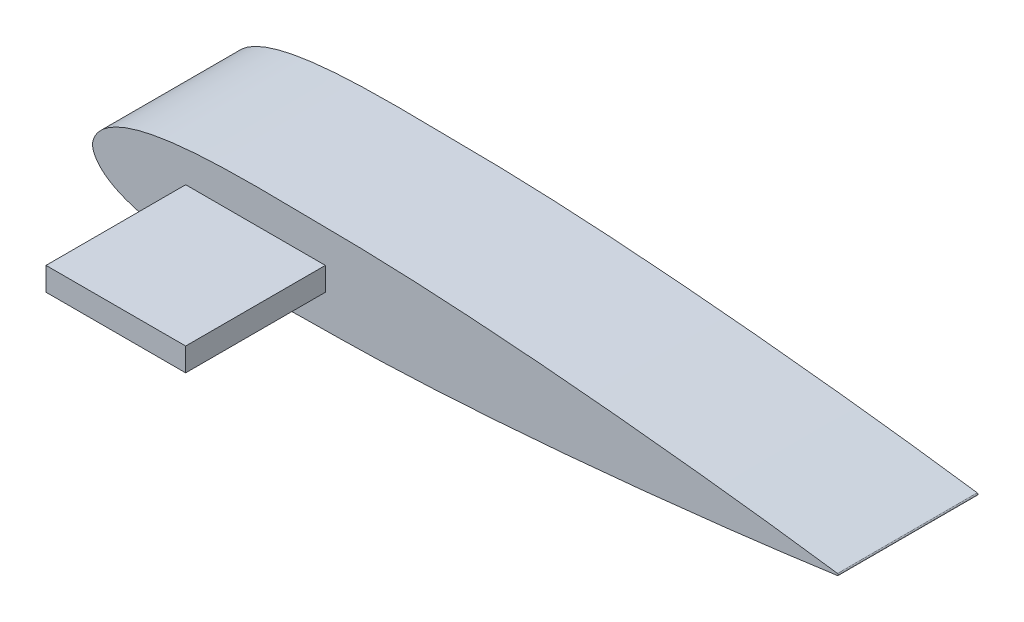
ISO-10303-21;
HEADER;
FILE_DESCRIPTION(('STEP AP214'),'2;1');
FILE_NAME('part.step','',(''),(''),'','','');
FILE_SCHEMA(('AUTOMOTIVE_DESIGN { 1 0 10303 214 1 1 1 1 }'));
ENDSEC;
DATA;
#1=APPLICATION_CONTEXT('core data for automotive mechanical design processes');
#2=APPLICATION_PROTOCOL_DEFINITION('international standard','automotive_design',2000,#1);
#3=PRODUCT_CONTEXT('',#1,'mechanical');
#4=PRODUCT('Part','Part','',(#3));
#5=PRODUCT_RELATED_PRODUCT_CATEGORY('part','',(#4));
#6=PRODUCT_DEFINITION_FORMATION('','',#4);
#7=PRODUCT_DEFINITION_CONTEXT('part definition',#1,'design');
#8=PRODUCT_DEFINITION('design','',#6,#7);
#9=PRODUCT_DEFINITION_SHAPE('','',#8);
#10=(LENGTH_UNIT() NAMED_UNIT(*) SI_UNIT(.MILLI.,.METRE.));
#11=(NAMED_UNIT(*) PLANE_ANGLE_UNIT() SI_UNIT($,.RADIAN.));
#12=(NAMED_UNIT(*) SI_UNIT($,.STERADIAN.) SOLID_ANGLE_UNIT());
#13=UNCERTAINTY_MEASURE_WITH_UNIT(LENGTH_MEASURE(1.E-05),#10,'distance_accuracy_value','');
#14=(GEOMETRIC_REPRESENTATION_CONTEXT(3) GLOBAL_UNCERTAINTY_ASSIGNED_CONTEXT((#13)) GLOBAL_UNIT_ASSIGNED_CONTEXT((#10,
#11,#12)) REPRESENTATION_CONTEXT('',''));
#15=CARTESIAN_POINT('',(0.,0.,0.));
#16=DIRECTION('',(0.,0.,1.));
#17=DIRECTION('',(1.,0.,0.));
#18=AXIS2_PLACEMENT_3D('',#15,#16,#17);
#19=CARTESIAN_POINT('',(0.,0.,19.05));
#20=DIRECTION('',(0.,0.,-1.));
#21=DIRECTION('',(-1.,0.,0.));
#22=AXIS2_PLACEMENT_3D('',#19,#20,#21);
#23=PLANE('',#22);
#24=CARTESIAN_POINT('',(101.6,0.128016,19.05));
#25=CARTESIAN_POINT('',(99.9070525686489,0.361535680483752,19.05));
#26=CARTESIAN_POINT('',(96.5229164717886,0.828332442992591,19.05));
#27=CARTESIAN_POINT('',(91.4421492577237,1.47630030962038,19.05));
#28=CARTESIAN_POINT('',(86.3620924886139,2.09178126516891,19.05));
#29=CARTESIAN_POINT('',(81.2818156311416,2.67021221482046,19.05));
#30=CARTESIAN_POINT('',(76.2017253814292,3.21595120615532,19.05));
#31=CARTESIAN_POINT('',(71.121704180204,3.72825746019504,19.05));
#32=CARTESIAN_POINT('',(66.0417841390404,4.20575704869902,19.05));
#33=CARTESIAN_POINT('',(60.9616764331955,4.64253588953135,19.05));
#34=CARTESIAN_POINT('',(55.8817526532358,5.03930700648654,19.05));
#35=CARTESIAN_POINT('',(50.7678428194317,5.38918365630372,19.05));
#36=CARTESIAN_POINT('',(45.6540861041713,5.68859269736138,19.05));
#37=CARTESIAN_POINT('',(40.539786385583,5.91027725447503,19.05));
#38=CARTESIAN_POINT('',(35.4594528350958,6.07407688155428,19.05));
#39=CARTESIAN_POINT('',(31.2585547163106,6.07121409884639,19.05));
#40=CARTESIAN_POINT('',(27.9062675236392,6.14928148727748,19.05));
#41=CARTESIAN_POINT('',(25.4001018022535,6.18417960376085,19.05));
#42=CARTESIAN_POINT('',(22.8600220343402,6.20252953344677,19.05));
#43=CARTESIAN_POINT('',(20.3197357018366,6.19130087341561,19.05));
#44=CARTESIAN_POINT('',(17.7791320847082,6.13859002493525,19.05));
#45=CARTESIAN_POINT('',(15.237819283157,6.03130684308064,19.05));
#46=CARTESIAN_POINT('',(12.6953765566976,5.84803534367875,19.05));
#47=CARTESIAN_POINT('',(10.3212425379229,5.58374145495773,19.05));
#48=CARTESIAN_POINT('',(8.1155285196929,5.22207188365709,19.05));
#49=CARTESIAN_POINT('',(6.42081947250496,4.83639909682632,19.05));
#50=CARTESIAN_POINT('',(5.07016160115596,4.42804218390638,19.05));
#51=CARTESIAN_POINT('',(4.04787795903987,4.0544099749082,19.05));
#52=CARTESIAN_POINT('',(3.01958674061395,3.58589384815148,19.05));
#53=CARTESIAN_POINT('',(1.97308490887708,2.97200164858176,19.05));
#54=CARTESIAN_POINT('',(1.10498460338645,2.25405553792827,19.05));
#55=CARTESIAN_POINT('',(0.340437319969994,1.29305291435777,19.05));
#56=CARTESIAN_POINT('',(-0.22230643968445,0.,19.05));
#57=CARTESIAN_POINT('',(0.340437319970007,-1.29305291435779,19.05));
#58=CARTESIAN_POINT('',(1.10498460338643,-2.25405553792825,19.05));
#59=CARTESIAN_POINT('',(1.97308490887709,-2.97200164858177,19.05));
#60=CARTESIAN_POINT('',(3.01958674061396,-3.58589384815148,19.05));
#61=CARTESIAN_POINT('',(4.04787795903985,-4.05440997490819,19.05));
#62=CARTESIAN_POINT('',(5.07016160115597,-4.42804218390638,19.05));
#63=CARTESIAN_POINT('',(6.42081947250497,-4.83639909682632,19.05));
#64=CARTESIAN_POINT('',(8.11552851969289,-5.22207188365709,19.05));
#65=CARTESIAN_POINT('',(10.3212425379228,-5.58374145495773,19.05));
#66=CARTESIAN_POINT('',(12.6953765566976,-5.84803534367876,19.05));
#67=CARTESIAN_POINT('',(15.237819283157,-6.03130684308063,19.05));
#68=CARTESIAN_POINT('',(17.7791320847082,-6.13859002493526,19.05));
#69=CARTESIAN_POINT('',(20.3197357018365,-6.19130087341561,19.05));
#70=CARTESIAN_POINT('',(22.8600220343402,-6.20252953344676,19.05));
#71=CARTESIAN_POINT('',(25.4001018022535,-6.18417960376085,19.05));
#72=CARTESIAN_POINT('',(27.9062675236393,-6.14928148727748,19.05));
#73=CARTESIAN_POINT('',(31.2585547163106,-6.07121409884639,19.05));
#74=CARTESIAN_POINT('',(35.4594528350959,-6.07407688155429,19.05));
#75=CARTESIAN_POINT('',(40.539786385583,-5.91027725447503,19.05));
#76=CARTESIAN_POINT('',(45.6540861041713,-5.68859269736138,19.05));
#77=CARTESIAN_POINT('',(50.7678428194317,-5.38918365630372,19.05));
#78=CARTESIAN_POINT('',(55.8817526532358,-5.03930700648654,19.05));
#79=CARTESIAN_POINT('',(60.9616764331955,-4.64253588953135,19.05));
#80=CARTESIAN_POINT('',(66.0417841390405,-4.20575704869902,19.05));
#81=CARTESIAN_POINT('',(71.121704180204,-3.72825746019504,19.05));
#82=CARTESIAN_POINT('',(76.2017253814292,-3.21595120615532,19.05));
#83=CARTESIAN_POINT('',(81.2818156311416,-2.67021221482046,19.05));
#84=CARTESIAN_POINT('',(86.3620924886139,-2.09178126516891,19.05));
#85=CARTESIAN_POINT('',(91.4421492577237,-1.47630030962038,19.05));
#86=CARTESIAN_POINT('',(96.5229164717886,-0.82833244299259,19.05));
#87=CARTESIAN_POINT('',(99.9070525686489,-0.361535680483752,19.05));
#88=CARTESIAN_POINT('',(101.6,-0.128016,19.05));
#89=B_SPLINE_CURVE_WITH_KNOTS('',3,(#24,#25,#26,#27,#28,#29,#30,#31,#32,#33,#34,#35,#36,#37,#38,
#39,#40,#41,#42,#43,#44,#45,#46,#47,#48,#49,#50,#51,#52,#53,#54,#55,#56,#57,#58,#59,#60,#61,#62,
#63,#64,#65,#66,#67,#68,#69,#70,#71,#72,#73,#74,#75,#76,#77,#78,#79,#80,#81,#82,#83,#84,#85,#86,
#87,#88),.UNSPECIFIED.,.F.,.F.,(4,1,1,1,1,1,1,1,1,1,1,1,1,1,1,1,1,1,1,1,1,1,1,1,1,1,1,1,1,1,1,1,
1,1,1,1,1,1,1,1,1,1,1,1,1,1,1,1,1,1,1,1,1,1,1,1,1,1,1,1,1,1,4),(0.,0.0246342312292194,
0.0492428704975633,0.0738297802420855,0.0983967509771365,0.12294599647171,0.147478561830958,
0.171994580547558,0.196493552150553,0.220976186079776,0.245442092511756,0.270380478282193,
0.29481296851854,0.319231823090472,0.343641966678299,0.355360377987929,0.367566080213977,
0.379770767093903,0.391975369032391,0.404182652687053,0.416398684188303,0.428636131953062,
0.440920171219084,0.450818129389003,0.460843203047005,0.465945570893321,0.471149096279721,
0.476522597740141,0.482208155426325,0.488618356982003,0.492567758031601,0.5,0.507432241968398,
0.511381643017996,0.517791844573675,0.523477402259858,0.528850903720279,0.534054429106679,
0.539156796952995,0.549181870610997,0.559079828780916,0.571363868046937,0.583601315811697,
0.595817347312947,0.608024630967609,0.620229232906097,0.632433919786023,0.644639622012071,
0.656358033321701,0.680768176909528,0.70518703148146,0.729619521717807,0.754557907488244,
0.779023813920224,0.803506447849447,0.828005419452442,0.852521438169042,0.87705400352829,
0.901603249022864,0.926170219757915,0.950757129502437,0.975365768770781,1.),.UNSPECIFIED.);
#90=CARTESIAN_POINT('',(101.6,0.128016,19.05));
#91=VERTEX_POINT('',#90);
#92=CARTESIAN_POINT('',(101.6,-0.128016,19.05));
#93=VERTEX_POINT('',#92);
#94=EDGE_CURVE('E117',#91,#93,#89,.T.);
#95=ORIENTED_EDGE('',*,*,#94,.T.);
#96=CARTESIAN_POINT('',(101.582341887962,0.,19.05));
#97=DIRECTION('',(0.,0.,-1.));
#98=DIRECTION('',(-1.,0.,0.));
#99=AXIS2_PLACEMENT_3D('',#96,#97,#98);
#100=CIRCLE('',#99,0.129228112950463);
#101=EDGE_CURVE('E122',#91,#93,#100,.T.);
#102=ORIENTED_EDGE('',*,*,#101,.F.);
#103=EDGE_LOOP('',(#95,#102));
#104=FACE_BOUND('',#103,.T.);
#105=DIRECTION('',(0.,1.,0.));
#106=VECTOR('',#105,1.);
#107=CARTESIAN_POINT('',(31.75,1.58749999999999,19.05));
#108=LINE('',#107,#106);
#109=CARTESIAN_POINT('',(31.75,-1.58750000000001,19.05));
#110=VERTEX_POINT('',#109);
#111=CARTESIAN_POINT('',(31.75,1.58749999999999,19.05));
#112=VERTEX_POINT('',#111);
#113=EDGE_CURVE('E108',#110,#112,#108,.T.);
#114=ORIENTED_EDGE('',*,*,#113,.F.);
#115=DIRECTION('',(1.,0.,0.));
#116=VECTOR('',#115,1.);
#117=CARTESIAN_POINT('',(12.7,-1.5875,19.05));
#118=LINE('',#117,#116);
#119=CARTESIAN_POINT('',(12.7,-1.5875,19.05));
#120=VERTEX_POINT('',#119);
#121=EDGE_CURVE('E105',#120,#110,#118,.T.);
#122=ORIENTED_EDGE('',*,*,#121,.F.);
#123=DIRECTION('',(0.,-1.,0.));
#124=VECTOR('',#123,1.);
#125=CARTESIAN_POINT('',(12.7,1.5875,19.05));
#126=LINE('',#125,#124);
#127=CARTESIAN_POINT('',(12.7,1.5875,19.05));
#128=VERTEX_POINT('',#127);
#129=EDGE_CURVE('E56',#128,#120,#126,.T.);
#130=ORIENTED_EDGE('',*,*,#129,.F.);
#131=DIRECTION('',(-1.,0.,0.));
#132=VECTOR('',#131,1.);
#133=CARTESIAN_POINT('',(12.7,1.5875,19.05));
#134=LINE('',#133,#132);
#135=EDGE_CURVE('E51',#112,#128,#134,.T.);
#136=ORIENTED_EDGE('',*,*,#135,.F.);
#137=EDGE_LOOP('',(#114,#122,#130,#136));
#138=FACE_BOUND('',#137,.T.);
#139=ADVANCED_FACE('F34',(#104,#138),#23,.F.);
#140=DIRECTION('',(0.,0.,-1.));
#141=VECTOR('',#140,1.);
#142=SURFACE_OF_LINEAR_EXTRUSION('',#89,#141);
#143=CARTESIAN_POINT('',(0.,0.,8.50265));
#144=CARTESIAN_POINT('',(5.27297745446789E-06,-0.0819379022860038,8.50264569991496));
#145=CARTESIAN_POINT('',(0.00576878084309566,-0.163906613489102,8.49793227856266));
#146=CARTESIAN_POINT('',(0.0270354998837502,-0.325579604478864,8.47945144242909));
#147=CARTESIAN_POINT('',(0.0425609251906983,-0.405278285050481,8.4656633741093));
#148=CARTESIAN_POINT('',(0.0878332213943048,-0.587876103637676,8.42361052006383));
#149=CARTESIAN_POINT('',(0.120645312125647,-0.689231418469879,8.39198283534314));
#150=CARTESIAN_POINT('',(0.194980823694499,-0.883483705903361,8.31578155192591));
#151=CARTESIAN_POINT('',(0.236519764525446,-0.976365180629454,8.27118483382805));
#152=CARTESIAN_POINT('',(0.337959118952399,-1.18044529217273,8.15504200917571));
#153=CARTESIAN_POINT('',(0.399573519638046,-1.28847022132582,8.07942617209769));
#154=CARTESIAN_POINT('',(0.52430615134443,-1.48880826277208,7.9103051719675));
#155=CARTESIAN_POINT('',(0.587426770939702,-1.58109422690754,7.81676967756697));
#156=CARTESIAN_POINT('',(0.679345749227089,-1.70676409420828,7.66349486531671));
#157=CARTESIAN_POINT('',(0.709668624037716,-1.74669344771915,7.60994262215782));
#158=CARTESIAN_POINT('',(0.76847278558102,-1.82180665001905,7.49867008001883));
#159=CARTESIAN_POINT('',(0.796953663116366,-1.85698944623881,7.44094886089335));
#160=CARTESIAN_POINT('',(0.878040658368946,-1.95461720174609,7.26198945296045));
#161=CARTESIAN_POINT('',(0.926616604668019,-2.00956897671471,7.13444211147783));
#162=CARTESIAN_POINT('',(0.989678604194627,-2.07902433424149,6.91525242990505));
#163=CARTESIAN_POINT('',(1.01013229922783,-2.10097104335402,6.82763779092426));
#164=CARTESIAN_POINT('',(1.04097151197828,-2.13376618627341,6.64864100314995));
#165=CARTESIAN_POINT('',(1.0513700237001,-2.14462894453492,6.55726387623182));
#166=CARTESIAN_POINT('',(1.06082348861863,-2.15451254259831,6.37293313514296));
#167=CARTESIAN_POINT('',(1.05983694164607,-2.15349005889316,6.27997498753979));
#168=CARTESIAN_POINT('',(1.04655407184701,-2.13958124329582,6.09576139502295));
#169=CARTESIAN_POINT('',(1.03425184927556,-2.12668872262346,6.00450686366257));
#170=CARTESIAN_POINT('',(1.00054510853139,-2.09066859802511,5.82974661096816));
#171=CARTESIAN_POINT('',(0.979518117744493,-2.06796404619203,5.74607725754933));
#172=CARTESIAN_POINT('',(0.930410143546462,-2.01354919355438,5.58393815026089));
#173=CARTESIAN_POINT('',(0.902324398494378,-1.98183281172488,5.50547195163561));
#174=CARTESIAN_POINT('',(0.825473592053192,-1.89214170333521,5.31576518706433));
#175=CARTESIAN_POINT('',(0.773469227593745,-1.82902621688164,5.20823088145486));
#176=CARTESIAN_POINT('',(0.69139006852295,-1.72263942199431,5.05763306391927));
#177=CARTESIAN_POINT('',(0.663305844048993,-1.68515906437614,5.00915231987606));
#178=CARTESIAN_POINT('',(0.6063615358489,-1.60645401872654,4.91579968003716));
#179=CARTESIAN_POINT('',(0.577501558170746,-1.56522984067325,4.87092729428121));
#180=CARTESIAN_POINT('',(0.519035664613744,-1.47847028133751,4.78415910983546));
#181=CARTESIAN_POINT('',(0.489425511097586,-1.43287232125673,4.74232876017643));
#182=CARTESIAN_POINT('',(0.430550761647529,-1.33813170866598,4.66265306723614));
#183=CARTESIAN_POINT('',(0.401286217933015,-1.28898852827253,4.62480831948342));
#184=CARTESIAN_POINT('',(0.315080522660227,-1.13642902840977,4.51755213949847));
#185=CARTESIAN_POINT('',(0.259590558916261,-1.02768781610142,4.45422312473935));
#186=CARTESIAN_POINT('',(0.173156067918237,-0.829166584260447,4.36132620389828));
#187=CARTESIAN_POINT('',(0.139682870947213,-0.742561649740116,4.32726857005532));
#188=CARTESIAN_POINT('',(0.0813519520906431,-0.562977588102633,4.27014985538041));
#189=CARTESIAN_POINT('',(0.0564787931701374,-0.470010244753397,4.24706904292772));
#190=CARTESIAN_POINT('',(0.0300360285614016,-0.335408732375718,4.22326248393349));
#191=CARTESIAN_POINT('',(0.023352858327886,-0.295627534311367,4.21736330992345));
#192=CARTESIAN_POINT('',(0.0123569025249586,-0.215468710190673,4.20778128666012));
#193=CARTESIAN_POINT('',(0.00804369421659355,-0.175091191822529,4.20409804213209));
#194=CARTESIAN_POINT('',(0.00203373570966123,-0.0940434445222412,4.1990223180909));
#195=CARTESIAN_POINT('',(0.000333875170249198,-0.0533736215215362,4.19762711527582));
#196=CARTESIAN_POINT('',(-0.000242639782308908,0.028000945779852,4.19714765050881));
#197=CARTESIAN_POINT('',(0.000880721042310461,0.0687056902678314,4.19806340102979));
#198=CARTESIAN_POINT('',(0.00578419873767443,0.149754638467166,4.20218274780663));
#199=CARTESIAN_POINT('',(0.00955917636691393,0.190099386975481,4.20538191863569));
#200=CARTESIAN_POINT('',(0.019515804630534,0.270244227284104,4.21399991956397));
#201=CARTESIAN_POINT('',(0.0256976408294799,0.310044276844109,4.2194189208099));
#202=CARTESIAN_POINT('',(0.047494346848156,0.428448719806667,4.23890292270258));
#203=CARTESIAN_POINT('',(0.0663524253880954,0.505946541120688,4.25618894042602));
#204=CARTESIAN_POINT('',(0.120401735917819,0.690422279938789,4.30792665038461));
#205=CARTESIAN_POINT('',(0.159126641486786,0.795154365339017,4.34659481021188));
#206=CARTESIAN_POINT('',(0.244591670356743,0.994743689506902,4.43781160565646));
#207=CARTESIAN_POINT('',(0.291341065214728,1.0895892993146,4.49037633585815));
#208=CARTESIAN_POINT('',(0.390095308934518,1.27173315435935,4.60965495196076));
#209=CARTESIAN_POINT('',(0.442215829679008,1.35871917035315,4.6767463756076));
#210=CARTESIAN_POINT('',(0.546817865009065,1.52156912619519,4.82332434097868));
#211=CARTESIAN_POINT('',(0.599299761626901,1.59741841883289,4.90282692766585));
#212=CARTESIAN_POINT('',(0.681459199181328,1.70959493505492,5.04015769257329));
#213=CARTESIAN_POINT('',(0.712037075639482,1.74978731034181,5.09432238456255));
#214=CARTESIAN_POINT('',(0.771289439250748,1.82532958743838,5.20689724469323));
#215=CARTESIAN_POINT('',(0.799963289602565,1.86067787330575,5.26530881965711));
#216=CARTESIAN_POINT('',(0.881522782108256,1.95866882444628,5.44652696590748));
#217=CARTESIAN_POINT('',(0.93023708224082,2.01363854329762,5.57577591525897));
#218=CARTESIAN_POINT('',(0.992658618542065,2.0822484732758,5.7967612282397));
#219=CARTESIAN_POINT('',(1.01264245815644,2.10365716434293,5.88436623004175));
#220=CARTESIAN_POINT('',(1.0425116223248,2.13538442951363,6.06321463959676));
#221=CARTESIAN_POINT('',(1.05241147113133,2.14571895516547,6.1544526171534));
#222=CARTESIAN_POINT('',(1.06090182573181,2.15459285052455,6.33836012370663));
#223=CARTESIAN_POINT('',(1.05945280133512,2.15309099183727,6.43103353333707));
#224=CARTESIAN_POINT('',(1.04534706974842,2.13831405652029,6.61458303454195));
#225=CARTESIAN_POINT('',(1.03268383593385,2.12503212392831,6.70545804796502));
#226=CARTESIAN_POINT('',(0.998323194600174,2.08827423535252,6.87979157643695));
#227=CARTESIAN_POINT('',(0.976960573719846,2.06517479187235,6.96339866558147));
#228=CARTESIAN_POINT('',(0.927242059395651,2.00998855361192,7.12536042657858));
#229=CARTESIAN_POINT('',(0.898881591632752,1.97789587830959,7.20371162000309));
#230=CARTESIAN_POINT('',(0.821314543264629,1.88715337862493,7.39335171928172));
#231=CARTESIAN_POINT('',(0.76888343496205,1.82333011868811,7.5008839972423));
#232=CARTESIAN_POINT('',(0.686251756924249,1.71583655215325,7.65139440515074));
#233=CARTESIAN_POINT('',(0.657996604779066,1.67797746168109,7.69983347274351));
#234=CARTESIAN_POINT('',(0.600741999170647,1.5984988458451,7.79307023090873));
#235=CARTESIAN_POINT('',(0.571742649791723,1.55687984431685,7.83786842708504));
#236=CARTESIAN_POINT('',(0.5130364065974,1.46932094502884,7.92443756573085));
#237=CARTESIAN_POINT('',(0.483325896912789,1.4233192947279,7.96614358758782));
#238=CARTESIAN_POINT('',(0.424299955660585,1.32775237342525,8.04553465284858));
#239=CARTESIAN_POINT('',(0.394984589305083,1.27818652255659,8.08321903947582));
#240=CARTESIAN_POINT('',(0.30872555410264,1.12434920553881,8.18991679105747));
#241=CARTESIAN_POINT('',(0.253318016666683,1.0147218714877,8.25278924606958));
#242=CARTESIAN_POINT('',(0.168548901931722,0.817427175612811,8.34340621984688));
#243=CARTESIAN_POINT('',(0.136382661226998,0.733172795845487,8.37602210707059));
#244=CARTESIAN_POINT('',(0.080253492237958,0.558766659413231,8.43086244315612));
#245=CARTESIAN_POINT('',(0.0562730679433934,0.468627977455501,8.45310909247439));
#246=CARTESIAN_POINT('',(0.0259749303990928,0.314954946989522,8.48039842188837));
#247=CARTESIAN_POINT('',(0.0164312088837174,0.252628272080054,8.48870809432831));
#248=CARTESIAN_POINT('',(0.00344427464361783,0.126873238916653,8.49983323132192));
#249=CARTESIAN_POINT('',(-4.08295252879061E-06,0.0634458554444164,8.50265332962604));
#250=CARTESIAN_POINT('',(0.,0.,8.50265));
#251=B_SPLINE_CURVE_WITH_KNOTS('',3,(#143,#144,#145,#146,#147,#148,#149,#150,#151,#152,#153,
#154,#155,#156,#157,#158,#159,#160,#161,#162,#163,#164,#165,#166,#167,#168,#169,#170,#171,#172,
#173,#174,#175,#176,#177,#178,#179,#180,#181,#182,#183,#184,#185,#186,#187,#188,#189,#190,#191,
#192,#193,#194,#195,#196,#197,#198,#199,#200,#201,#202,#203,#204,#205,#206,#207,#208,#209,#210,
#211,#212,#213,#214,#215,#216,#217,#218,#219,#220,#221,#222,#223,#224,#225,#226,#227,#228,#229,
#230,#231,#232,#233,#234,#235,#236,#237,#238,#239,#240,#241,#242,#243,#244,#245,#246,#247,#248,
#249,#250),.UNSPECIFIED.,.T.,.F.,(4,2,2,2,2,2,2,2,2,2,2,2,2,2,2,2,2,2,2,2,2,2,2,2,2,2,2,2,2,2,2,
2,2,2,2,2,2,2,2,2,2,2,2,2,2,2,2,2,2,2,2,2,2,4),(0.,0.245595669771203,0.491752247582453,
0.823309390287595,1.15546124892713,1.58995246354412,2.02518571450882,2.24499591870829,
2.46485478691565,2.90237428300696,3.17913015097736,3.45552789598302,3.73293346762611,
4.01048375447991,4.27710408650471,4.54390475826577,4.94684221691806,5.14892533070147,
5.35098095816947,5.55655550768536,5.76216073069467,6.17245600473625,6.46827168746213,
6.76355359146444,6.88575113418767,7.00792687299739,7.12995708843362,7.25198796250462,
7.3737829722361,7.49558737400879,7.73952631969193,8.09212898668773,8.44514183010785,
8.80875698269923,9.17284616484256,9.39472273456687,9.6166731409679,10.0586116684593,
10.3346527266896,10.6102956306885,10.8868990749727,11.1636636072181,11.4306555421628,
11.6978224676269,12.1022376226198,12.3050775002582,12.5078891614412,12.7141713542236,
12.9204871837333,13.3321097463508,13.6189914446732,13.9052560778204,14.0955855413952,
14.2857542780524),.UNSPECIFIED.);
#252=CARTESIAN_POINT('',(0.,0.,8.50265));
#253=VERTEX_POINT('',#252);
#254=EDGE_CURVE('E165',#253,#253,#251,.T.);
#255=ORIENTED_EDGE('',*,*,#254,.T.);
#256=EDGE_LOOP('',(#255));
#257=FACE_BOUND('',#256,.T.);
#258=CARTESIAN_POINT('',(101.6,0.128016,0.));
#259=CARTESIAN_POINT('',(99.9070525686489,0.361535680483752,0.));
#260=CARTESIAN_POINT('',(96.5229164717886,0.828332442992591,0.));
#261=CARTESIAN_POINT('',(91.4421492577237,1.47630030962038,0.));
#262=CARTESIAN_POINT('',(86.3620924886139,2.09178126516891,0.));
#263=CARTESIAN_POINT('',(81.2818156311416,2.67021221482046,0.));
#264=CARTESIAN_POINT('',(76.2017253814292,3.21595120615532,0.));
#265=CARTESIAN_POINT('',(71.121704180204,3.72825746019504,0.));
#266=CARTESIAN_POINT('',(66.0417841390404,4.20575704869902,0.));
#267=CARTESIAN_POINT('',(60.9616764331955,4.64253588953135,0.));
#268=CARTESIAN_POINT('',(55.8817526532358,5.03930700648654,0.));
#269=CARTESIAN_POINT('',(50.7678428194317,5.38918365630372,0.));
#270=CARTESIAN_POINT('',(45.6540861041713,5.68859269736138,0.));
#271=CARTESIAN_POINT('',(40.539786385583,5.91027725447503,0.));
#272=CARTESIAN_POINT('',(35.4594528350958,6.07407688155428,0.));
#273=CARTESIAN_POINT('',(31.2585547163106,6.07121409884639,0.));
#274=CARTESIAN_POINT('',(27.9062675236392,6.14928148727748,0.));
#275=CARTESIAN_POINT('',(25.4001018022535,6.18417960376085,0.));
#276=CARTESIAN_POINT('',(22.8600220343402,6.20252953344677,0.));
#277=CARTESIAN_POINT('',(20.3197357018366,6.19130087341561,0.));
#278=CARTESIAN_POINT('',(17.7791320847082,6.13859002493525,0.));
#279=CARTESIAN_POINT('',(15.237819283157,6.03130684308064,0.));
#280=CARTESIAN_POINT('',(12.6953765566976,5.84803534367875,0.));
#281=CARTESIAN_POINT('',(10.3212425379229,5.58374145495773,0.));
#282=CARTESIAN_POINT('',(8.1155285196929,5.22207188365709,0.));
#283=CARTESIAN_POINT('',(6.42081947250496,4.83639909682632,0.));
#284=CARTESIAN_POINT('',(5.07016160115596,4.42804218390638,0.));
#285=CARTESIAN_POINT('',(4.04787795903987,4.0544099749082,0.));
#286=CARTESIAN_POINT('',(3.01958674061395,3.58589384815148,0.));
#287=CARTESIAN_POINT('',(1.97308490887708,2.97200164858176,0.));
#288=CARTESIAN_POINT('',(1.10498460338645,2.25405553792827,0.));
#289=CARTESIAN_POINT('',(0.340437319969994,1.29305291435777,0.));
#290=CARTESIAN_POINT('',(-0.22230643968445,0.,0.));
#291=CARTESIAN_POINT('',(0.340437319970007,-1.29305291435779,0.));
#292=CARTESIAN_POINT('',(1.10498460338643,-2.25405553792825,0.));
#293=CARTESIAN_POINT('',(1.97308490887709,-2.97200164858177,0.));
#294=CARTESIAN_POINT('',(3.01958674061396,-3.58589384815148,0.));
#295=CARTESIAN_POINT('',(4.04787795903985,-4.05440997490819,0.));
#296=CARTESIAN_POINT('',(5.07016160115597,-4.42804218390638,0.));
#297=CARTESIAN_POINT('',(6.42081947250497,-4.83639909682632,0.));
#298=CARTESIAN_POINT('',(8.11552851969289,-5.22207188365709,0.));
#299=CARTESIAN_POINT('',(10.3212425379228,-5.58374145495773,0.));
#300=CARTESIAN_POINT('',(12.6953765566976,-5.84803534367876,0.));
#301=CARTESIAN_POINT('',(15.237819283157,-6.03130684308063,0.));
#302=CARTESIAN_POINT('',(17.7791320847082,-6.13859002493526,0.));
#303=CARTESIAN_POINT('',(20.3197357018365,-6.19130087341561,0.));
#304=CARTESIAN_POINT('',(22.8600220343402,-6.20252953344676,0.));
#305=CARTESIAN_POINT('',(25.4001018022535,-6.18417960376085,0.));
#306=CARTESIAN_POINT('',(27.9062675236393,-6.14928148727748,0.));
#307=CARTESIAN_POINT('',(31.2585547163106,-6.07121409884639,0.));
#308=CARTESIAN_POINT('',(35.4594528350959,-6.07407688155429,0.));
#309=CARTESIAN_POINT('',(40.539786385583,-5.91027725447503,0.));
#310=CARTESIAN_POINT('',(45.6540861041713,-5.68859269736138,0.));
#311=CARTESIAN_POINT('',(50.7678428194317,-5.38918365630372,0.));
#312=CARTESIAN_POINT('',(55.8817526532358,-5.03930700648654,0.));
#313=CARTESIAN_POINT('',(60.9616764331955,-4.64253588953135,0.));
#314=CARTESIAN_POINT('',(66.0417841390405,-4.20575704869902,0.));
#315=CARTESIAN_POINT('',(71.121704180204,-3.72825746019504,0.));
#316=CARTESIAN_POINT('',(76.2017253814292,-3.21595120615532,0.));
#317=CARTESIAN_POINT('',(81.2818156311416,-2.67021221482046,0.));
#318=CARTESIAN_POINT('',(86.3620924886139,-2.09178126516891,0.));
#319=CARTESIAN_POINT('',(91.4421492577237,-1.47630030962038,0.));
#320=CARTESIAN_POINT('',(96.5229164717886,-0.82833244299259,0.));
#321=CARTESIAN_POINT('',(99.9070525686489,-0.361535680483752,0.));
#322=CARTESIAN_POINT('',(101.6,-0.128016,0.));
#323=B_SPLINE_CURVE_WITH_KNOTS('',3,(#258,#259,#260,#261,#262,#263,#264,#265,#266,#267,#268,
#269,#270,#271,#272,#273,#274,#275,#276,#277,#278,#279,#280,#281,#282,#283,#284,#285,#286,#287,
#288,#289,#290,#291,#292,#293,#294,#295,#296,#297,#298,#299,#300,#301,#302,#303,#304,#305,#306,
#307,#308,#309,#310,#311,#312,#313,#314,#315,#316,#317,#318,#319,#320,#321,#322),.UNSPECIFIED.,
.F.,.F.,(4,1,1,1,1,1,1,1,1,1,1,1,1,1,1,1,1,1,1,1,1,1,1,1,1,1,1,1,1,1,1,1,1,1,1,1,1,1,1,1,1,1,1,
1,1,1,1,1,1,1,1,1,1,1,1,1,1,1,1,1,1,1,4),(0.,0.0246342312292194,0.0492428704975633,
0.0738297802420855,0.0983967509771365,0.12294599647171,0.147478561830958,0.171994580547558,
0.196493552150553,0.220976186079776,0.245442092511756,0.270380478282193,0.29481296851854,
0.319231823090472,0.343641966678299,0.355360377987929,0.367566080213977,0.379770767093903,
0.391975369032391,0.404182652687053,0.416398684188303,0.428636131953062,0.440920171219084,
0.450818129389003,0.460843203047005,0.465945570893321,0.471149096279721,0.476522597740141,
0.482208155426325,0.488618356982003,0.492567758031601,0.5,0.507432241968398,0.511381643017996,
0.517791844573675,0.523477402259858,0.528850903720279,0.534054429106679,0.539156796952995,
0.549181870610997,0.559079828780916,0.571363868046937,0.583601315811697,0.595817347312947,
0.608024630967609,0.620229232906097,0.632433919786023,0.644639622012071,0.656358033321701,
0.680768176909528,0.70518703148146,0.729619521717807,0.754557907488244,0.779023813920224,
0.803506447849447,0.828005419452442,0.852521438169042,0.87705400352829,0.901603249022864,
0.926170219757915,0.950757129502437,0.975365768770781,1.),.UNSPECIFIED.);
#324=CARTESIAN_POINT('',(101.6,0.128016,0.));
#325=VERTEX_POINT('',#324);
#326=CARTESIAN_POINT('',(101.6,-0.128016,0.));
#327=VERTEX_POINT('',#326);
#328=EDGE_CURVE('E109',#325,#327,#323,.T.);
#329=ORIENTED_EDGE('',*,*,#328,.T.);
#330=DIRECTION('',(0.,0.,-1.));
#331=VECTOR('',#330,1.);
#332=CARTESIAN_POINT('',(101.6,-0.128016,19.05));
#333=LINE('',#332,#331);
#334=EDGE_CURVE('E11',#93,#327,#333,.T.);
#335=ORIENTED_EDGE('',*,*,#334,.F.);
#336=ORIENTED_EDGE('',*,*,#94,.F.);
#337=DIRECTION('',(0.,0.,-1.));
#338=VECTOR('',#337,1.);
#339=CARTESIAN_POINT('',(101.6,0.128016,19.05));
#340=LINE('',#339,#338);
#341=EDGE_CURVE('E44',#91,#325,#340,.T.);
#342=ORIENTED_EDGE('',*,*,#341,.T.);
#343=EDGE_LOOP('',(#329,#335,#336,#342));
#344=FACE_BOUND('',#343,.T.);
#345=ADVANCED_FACE('F36',(#257,#344),#142,.F.);
#346=CARTESIAN_POINT('',(101.582341887962,0.,19.05));
#347=DIRECTION('',(0.,0.,-1.));
#348=DIRECTION('',(-1.,0.,0.));
#349=AXIS2_PLACEMENT_3D('',#346,#347,#348);
#350=CYLINDRICAL_SURFACE('',#349,0.129228112950463);
#351=CARTESIAN_POINT('',(101.582341887962,0.,0.));
#352=DIRECTION('',(0.,0.,-1.));
#353=DIRECTION('',(-1.,0.,0.));
#354=AXIS2_PLACEMENT_3D('',#351,#352,#353);
#355=CIRCLE('',#354,0.129228112950463);
#356=EDGE_CURVE('E112',#325,#327,#355,.T.);
#357=ORIENTED_EDGE('',*,*,#356,.F.);
#358=ORIENTED_EDGE('',*,*,#341,.F.);
#359=ORIENTED_EDGE('',*,*,#101,.T.);
#360=ORIENTED_EDGE('',*,*,#334,.T.);
#361=EDGE_LOOP('',(#357,#358,#359,#360));
#362=FACE_BOUND('',#361,.T.);
#363=ADVANCED_FACE('F143',(#362),#350,.T.);
#364=CARTESIAN_POINT('',(0.,0.,0.));
#365=DIRECTION('',(0.,0.,-1.));
#366=DIRECTION('',(-1.,0.,0.));
#367=AXIS2_PLACEMENT_3D('',#364,#365,#366);
#368=PLANE('',#367);
#369=CARTESIAN_POINT('',(22.225,0.,0.));
#370=DIRECTION('',(0.,0.,-1.));
#371=DIRECTION('',(-1.,0.,0.));
#372=AXIS2_PLACEMENT_3D('',#369,#370,#371);
#373=CIRCLE('',#372,5.55625);
#374=CARTESIAN_POINT('',(16.66875,0.,0.));
#375=VERTEX_POINT('',#374);
#376=EDGE_CURVE('E162',#375,#375,#373,.T.);
#377=ORIENTED_EDGE('',*,*,#376,.F.);
#378=EDGE_LOOP('',(#377));
#379=FACE_BOUND('',#378,.T.);
#380=ORIENTED_EDGE('',*,*,#328,.F.);
#381=ORIENTED_EDGE('',*,*,#356,.T.);
#382=EDGE_LOOP('',(#380,#381));
#383=FACE_BOUND('',#382,.T.);
#384=ADVANCED_FACE('F142',(#379,#383),#368,.T.);
#385=CARTESIAN_POINT('',(31.75,1.58749999999999,38.1));
#386=DIRECTION('',(-1.,0.,0.));
#387=DIRECTION('',(0.,0.,1.));
#388=AXIS2_PLACEMENT_3D('',#385,#386,#387);
#389=PLANE('',#388);
#390=ORIENTED_EDGE('',*,*,#113,.T.);
#391=DIRECTION('',(0.,0.,-1.));
#392=VECTOR('',#391,1.);
#393=CARTESIAN_POINT('',(31.75,1.58749999999999,38.1));
#394=LINE('',#393,#392);
#395=CARTESIAN_POINT('',(31.75,1.58749999999999,38.1));
#396=VERTEX_POINT('',#395);
#397=EDGE_CURVE('E89',#396,#112,#394,.T.);
#398=ORIENTED_EDGE('',*,*,#397,.F.);
#399=DIRECTION('',(0.,1.,0.));
#400=VECTOR('',#399,1.);
#401=CARTESIAN_POINT('',(31.75,1.58749999999999,38.1));
#402=LINE('',#401,#400);
#403=CARTESIAN_POINT('',(31.75,-1.58750000000001,38.1));
#404=VERTEX_POINT('',#403);
#405=EDGE_CURVE('E96',#404,#396,#402,.T.);
#406=ORIENTED_EDGE('',*,*,#405,.F.);
#407=DIRECTION('',(0.,0.,-1.));
#408=VECTOR('',#407,1.);
#409=CARTESIAN_POINT('',(31.75,-1.58750000000001,38.1));
#410=LINE('',#409,#408);
#411=EDGE_CURVE('E153',#404,#110,#410,.T.);
#412=ORIENTED_EDGE('',*,*,#411,.T.);
#413=EDGE_LOOP('',(#390,#398,#406,#412));
#414=FACE_BOUND('',#413,.T.);
#415=ADVANCED_FACE('F107',(#414),#389,.F.);
#416=CARTESIAN_POINT('',(12.7,1.5875,38.1));
#417=DIRECTION('',(0.,-1.,0.));
#418=DIRECTION('',(1.,0.,0.));
#419=AXIS2_PLACEMENT_3D('',#416,#417,#418);
#420=PLANE('',#419);
#421=ORIENTED_EDGE('',*,*,#135,.T.);
#422=DIRECTION('',(0.,0.,-1.));
#423=VECTOR('',#422,1.);
#424=CARTESIAN_POINT('',(12.7,1.5875,38.1));
#425=LINE('',#424,#423);
#426=CARTESIAN_POINT('',(12.7,1.5875,38.1));
#427=VERTEX_POINT('',#426);
#428=EDGE_CURVE('E92',#427,#128,#425,.T.);
#429=ORIENTED_EDGE('',*,*,#428,.F.);
#430=DIRECTION('',(-1.,0.,0.));
#431=VECTOR('',#430,1.);
#432=CARTESIAN_POINT('',(12.7,1.5875,38.1));
#433=LINE('',#432,#431);
#434=EDGE_CURVE('E85',#396,#427,#433,.T.);
#435=ORIENTED_EDGE('',*,*,#434,.F.);
#436=ORIENTED_EDGE('',*,*,#397,.T.);
#437=EDGE_LOOP('',(#421,#429,#435,#436));
#438=FACE_BOUND('',#437,.T.);
#439=ADVANCED_FACE('F87',(#438),#420,.F.);
#440=CARTESIAN_POINT('',(12.7,1.5875,38.1));
#441=DIRECTION('',(1.,0.,0.));
#442=DIRECTION('',(0.,1.,0.));
#443=AXIS2_PLACEMENT_3D('',#440,#441,#442);
#444=PLANE('',#443);
#445=ORIENTED_EDGE('',*,*,#129,.T.);
#446=DIRECTION('',(0.,0.,-1.));
#447=VECTOR('',#446,1.);
#448=CARTESIAN_POINT('',(12.7,-1.5875,38.1));
#449=LINE('',#448,#447);
#450=CARTESIAN_POINT('',(12.7,-1.5875,38.1));
#451=VERTEX_POINT('',#450);
#452=EDGE_CURVE('E114',#451,#120,#449,.T.);
#453=ORIENTED_EDGE('',*,*,#452,.F.);
#454=DIRECTION('',(0.,-1.,0.));
#455=VECTOR('',#454,1.);
#456=CARTESIAN_POINT('',(12.7,1.5875,38.1));
#457=LINE('',#456,#455);
#458=EDGE_CURVE('E95',#427,#451,#457,.T.);
#459=ORIENTED_EDGE('',*,*,#458,.F.);
#460=ORIENTED_EDGE('',*,*,#428,.T.);
#461=EDGE_LOOP('',(#445,#453,#459,#460));
#462=FACE_BOUND('',#461,.T.);
#463=ADVANCED_FACE('F196',(#462),#444,.F.);
#464=CARTESIAN_POINT('',(12.7,-1.5875,38.1));
#465=DIRECTION('',(0.,1.,0.));
#466=DIRECTION('',(-1.,0.,0.));
#467=AXIS2_PLACEMENT_3D('',#464,#465,#466);
#468=PLANE('',#467);
#469=ORIENTED_EDGE('',*,*,#121,.T.);
#470=ORIENTED_EDGE('',*,*,#411,.F.);
#471=DIRECTION('',(1.,0.,0.));
#472=VECTOR('',#471,1.);
#473=CARTESIAN_POINT('',(12.7,-1.5875,38.1));
#474=LINE('',#473,#472);
#475=EDGE_CURVE('E101',#451,#404,#474,.T.);
#476=ORIENTED_EDGE('',*,*,#475,.F.);
#477=ORIENTED_EDGE('',*,*,#452,.T.);
#478=EDGE_LOOP('',(#469,#470,#476,#477));
#479=FACE_BOUND('',#478,.T.);
#480=ADVANCED_FACE('F152',(#479),#468,.F.);
#481=CARTESIAN_POINT('',(0.,0.,38.1));
#482=DIRECTION('',(0.,0.,1.));
#483=DIRECTION('',(1.,0.,0.));
#484=AXIS2_PLACEMENT_3D('',#481,#482,#483);
#485=PLANE('',#484);
#486=ORIENTED_EDGE('',*,*,#405,.T.);
#487=ORIENTED_EDGE('',*,*,#434,.T.);
#488=ORIENTED_EDGE('',*,*,#458,.T.);
#489=ORIENTED_EDGE('',*,*,#475,.T.);
#490=EDGE_LOOP('',(#486,#487,#488,#489));
#491=FACE_BOUND('',#490,.T.);
#492=ADVANCED_FACE('F99',(#491),#485,.T.);
#493=CARTESIAN_POINT('',(22.225,0.,12.7));
#494=DIRECTION('',(0.,0.,-1.));
#495=DIRECTION('',(-1.,0.,0.));
#496=AXIS2_PLACEMENT_3D('',#493,#494,#495);
#497=CYLINDRICAL_SURFACE('',#496,5.55625);
#498=CARTESIAN_POINT('',(16.66875,0.,8.50265));
#499=CARTESIAN_POINT('',(16.6687457419241,0.116302792810947,8.50265555886253));
#500=CARTESIAN_POINT('',(16.6724327761248,0.232568883380204,8.49319566056065));
#501=CARTESIAN_POINT('',(16.6867705943625,0.461611480134431,8.45577147464932));
#502=CARTESIAN_POINT('',(16.6974198713713,0.574388735971524,8.42781119156731));
#503=CARTESIAN_POINT('',(16.7245437187617,0.79311598738199,8.35453359250899));
#504=CARTESIAN_POINT('',(16.7410065866975,0.899079196430785,8.30925113001276));
#505=CARTESIAN_POINT('',(16.7781303522677,1.10189281758096,8.20279806878524));
#506=CARTESIAN_POINT('',(16.798792450689,1.19874061147643,8.14162292408172));
#507=CARTESIAN_POINT('',(16.8432307110914,1.38492110095493,8.00225883505118));
#508=CARTESIAN_POINT('',(16.8670990302661,1.47379134076334,7.92348177160227));
#509=CARTESIAN_POINT('',(16.9148218595881,1.63743741336873,7.75239855760251));
#510=CARTESIAN_POINT('',(16.9386763623986,1.71220849935827,7.66008786916889));
#511=CARTESIAN_POINT('',(16.9847624415829,1.84857442286396,7.45992378455668));
#512=CARTESIAN_POINT('',(17.0068865800279,1.90949903889618,7.35158653990402));
#513=CARTESIAN_POINT('',(17.0455625002183,2.01205564210115,7.1252131077968));
#514=CARTESIAN_POINT('',(17.062116677905,2.05369592741622,7.00718111782907));
#515=CARTESIAN_POINT('',(17.086787979979,2.11464811586899,6.77010505851493));
#516=CARTESIAN_POINT('',(17.0952386305024,2.13484673262649,6.65132489023959));
#517=CARTESIAN_POINT('',(17.1037177252175,2.15511369164851,6.41178344207415));
#518=CARTESIAN_POINT('',(17.1037499557849,2.1551910838911,6.29102307726435));
#519=CARTESIAN_POINT('',(17.0956746095893,2.13588833023181,6.05925719378167));
#520=CARTESIAN_POINT('',(17.0880924770858,2.1177642140501,5.94812528279883));
#521=CARTESIAN_POINT('',(17.0665202193667,2.06465811652558,5.73062472807659));
#522=CARTESIAN_POINT('',(17.0525290614216,2.02967341827578,5.62425685503239));
#523=CARTESIAN_POINT('',(17.0194162874845,1.94318930257142,5.41683539909861));
#524=CARTESIAN_POINT('',(17.0001991033068,1.89137836037993,5.3159276385949));
#525=CARTESIAN_POINT('',(16.9588286705361,1.77293030492325,5.12388429348971));
#526=CARTESIAN_POINT('',(16.9366743629481,1.70628783816496,5.03275225511814));
#527=CARTESIAN_POINT('',(16.8899783260629,1.55441407473108,4.85593197554837));
#528=CARTESIAN_POINT('',(16.8653796471328,1.46818877712459,4.77111034888985));
#529=CARTESIAN_POINT('',(16.8179326325512,1.28246419629387,4.61686363817709));
#530=CARTESIAN_POINT('',(16.7950846038189,1.18296259384881,4.5474412498505));
#531=CARTESIAN_POINT('',(16.7532028960634,0.971178468744457,4.42492028059173));
#532=CARTESIAN_POINT('',(16.7342429592113,0.858702764756306,4.37212860186825));
#533=CARTESIAN_POINT('',(16.702825675293,0.625547558518386,4.28650911732325));
#534=CARTESIAN_POINT('',(16.6903652376931,0.504871986244079,4.25367182189787));
#535=CARTESIAN_POINT('',(16.6739040217378,0.266021856557523,4.2106016151138));
#536=CARTESIAN_POINT('',(16.6694674770847,0.148087401530734,4.19920288527941));
#537=CARTESIAN_POINT('',(16.6681945433967,-0.0880800309557171,4.19591532664678));
#538=CARTESIAN_POINT('',(16.6713563322067,-0.206312930052993,4.20402182030445));
#539=CARTESIAN_POINT('',(16.6846382430531,-0.43456283553657,4.23864221837706));
#540=CARTESIAN_POINT('',(16.6944635761299,-0.544717047414098,4.26437674042134));
#541=CARTESIAN_POINT('',(16.7197838443377,-0.759054887021933,4.33247972876859));
#542=CARTESIAN_POINT('',(16.7352795137776,-0.863237739439039,4.37485034949863));
#543=CARTESIAN_POINT('',(16.7710021053713,-1.06619068548477,4.47639328913356));
#544=CARTESIAN_POINT('',(16.7913572104308,-1.16470404406585,4.53603224350591));
#545=CARTESIAN_POINT('',(16.8345686073916,-1.35066359516052,4.66989652976794));
#546=CARTESIAN_POINT('',(16.857425862582,-1.43810549719691,4.74412748816706));
#547=CARTESIAN_POINT('',(16.9048948853194,-1.60511586747893,4.91047244564479));
#548=CARTESIAN_POINT('',(16.9295276070494,-1.68386071009844,5.00340954608011));
#549=CARTESIAN_POINT('',(16.9764303744445,-1.82481912252356,5.20164077063329));
#550=CARTESIAN_POINT('',(16.9987001260736,-1.88703063645133,5.30693642916211));
#551=CARTESIAN_POINT('',(17.0383207822202,-1.99337179883402,5.5281009491644));
#552=CARTESIAN_POINT('',(17.0556376518264,-2.03737721989454,5.64403606298342));
#553=CARTESIAN_POINT('',(17.082767956204,-2.10492616228104,5.8825369855764));
#554=CARTESIAN_POINT('',(17.0925864657794,-2.12848352409655,6.00509824958775));
#555=CARTESIAN_POINT('',(17.1029048945512,-2.15318791795807,6.24438130780973));
#556=CARTESIAN_POINT('',(17.1039937803672,-2.1557516151283,6.36093250769182));
#557=CARTESIAN_POINT('',(17.098255950377,-2.14207000391364,6.59271571681256));
#558=CARTESIAN_POINT('',(17.0914300960857,-2.12582674265546,6.7079478682502));
#559=CARTESIAN_POINT('',(17.0711367803565,-2.07612259043577,6.92973290930214));
#560=CARTESIAN_POINT('',(17.057908644628,-2.04328036735808,7.03644828011897));
#561=CARTESIAN_POINT('',(17.0264552693846,-1.96187191221491,7.24290706670118));
#562=CARTESIAN_POINT('',(17.0082287287568,-1.91330158543942,7.34264865865725));
#563=CARTESIAN_POINT('',(16.9675888474027,-1.79872859836131,7.53828617491098));
#564=CARTESIAN_POINT('',(16.9450006338585,-1.7319155575148,7.63367067161088));
#565=CARTESIAN_POINT('',(16.898749447672,-1.58397329975352,7.81232444530773));
#566=CARTESIAN_POINT('',(16.8750861239535,-1.50283938105065,7.89558972692779));
#567=CARTESIAN_POINT('',(16.8276649862227,-1.32281525893082,8.05269138083002));
#568=CARTESIAN_POINT('',(16.8039848050491,-1.22315734165972,8.1256756444951));
#569=CARTESIAN_POINT('',(16.7606561321918,-1.01215344730445,8.25386152303542));
#570=CARTESIAN_POINT('',(16.7410084279696,-0.900805193737769,8.30905966583656));
#571=CARTESIAN_POINT('',(16.706796863815,-0.661063255104721,8.40295379414282));
#572=CARTESIAN_POINT('',(16.6926995650112,-0.532019701422809,8.44017958488572));
#573=CARTESIAN_POINT('',(16.6736813214893,-0.268632318890032,8.49001715549919));
#574=CARTESIAN_POINT('',(16.6687549166852,-0.134291692451768,8.50264358133163));
#575=CARTESIAN_POINT('',(16.66875,0.,8.50265));
#576=B_SPLINE_CURVE_WITH_KNOTS('',3,(#498,#499,#500,#501,#502,#503,#504,#505,#506,#507,#508,
#509,#510,#511,#512,#513,#514,#515,#516,#517,#518,#519,#520,#521,#522,#523,#524,#525,#526,#527,
#528,#529,#530,#531,#532,#533,#534,#535,#536,#537,#538,#539,#540,#541,#542,#543,#544,#545,#546,
#547,#548,#549,#550,#551,#552,#553,#554,#555,#556,#557,#558,#559,#560,#561,#562,#563,#564,#565,
#566,#567,#568,#569,#570,#571,#572,#573,#574,#575),.UNSPECIFIED.,.T.,.F.,(4,2,2,2,2,2,2,2,2,2,2,
2,2,2,2,2,2,2,2,2,2,2,2,2,2,2,2,2,2,2,2,2,2,2,2,2,2,2,4),(0.,0.348412735707405,
0.696750079894947,1.04439019957401,1.39212986857458,1.75393577585307,2.11586327684853,
2.4927104369066,2.86939528676283,3.22981060341331,3.59006381480274,3.92705586251957,
4.26410223115695,4.60778311336856,4.9515882502332,5.32018867509693,5.68885357480943,
6.06396961827199,6.43890712982415,6.7927896707966,7.14658735571999,7.48567437498619,
7.82480532157875,8.17412727715146,8.52358419241104,8.89469522448679,9.26585238171736,
9.63950190780597,10.0128983275253,10.3608708939228,10.708805587265,11.0446355072595,
11.3805529287873,11.7349049124088,12.0893734529574,12.4648651501635,12.840430103718,
13.2429726147691,13.6452753868613),.UNSPECIFIED.);
#577=CARTESIAN_POINT('',(16.66875,0.,8.50265));
#578=VERTEX_POINT('',#577);
#579=EDGE_CURVE('E173',#578,#578,#576,.T.);
#580=ORIENTED_EDGE('',*,*,#579,.T.);
#581=EDGE_LOOP('',(#580));
#582=FACE_BOUND('',#581,.T.);
#583=CARTESIAN_POINT('',(22.225,0.,12.7));
#584=DIRECTION('',(0.,0.,-1.));
#585=DIRECTION('',(-1.,0.,0.));
#586=AXIS2_PLACEMENT_3D('',#583,#584,#585);
#587=CIRCLE('',#586,5.55625);
#588=CARTESIAN_POINT('',(16.66875,0.,12.7));
#589=VERTEX_POINT('',#588);
#590=EDGE_CURVE('E148',#589,#589,#587,.T.);
#591=ORIENTED_EDGE('',*,*,#590,.F.);
#592=EDGE_LOOP('',(#591));
#593=FACE_BOUND('',#592,.T.);
#594=ORIENTED_EDGE('',*,*,#376,.T.);
#595=EDGE_LOOP('',(#594));
#596=FACE_BOUND('',#595,.T.);
#597=ADVANCED_FACE('F187',(#582,#593,#596),#497,.F.);
#598=CARTESIAN_POINT('',(22.225,0.,12.7));
#599=DIRECTION('',(0.,0.,-1.));
#600=DIRECTION('',(-1.,0.,0.));
#601=AXIS2_PLACEMENT_3D('',#598,#599,#600);
#602=PLANE('',#601);
#603=ORIENTED_EDGE('',*,*,#590,.T.);
#604=EDGE_LOOP('',(#603));
#605=FACE_BOUND('',#604,.T.);
#606=ADVANCED_FACE('F180',(#605),#602,.T.);
#607=CARTESIAN_POINT('',(0.,0.,6.35));
#608=DIRECTION('',(-1.,0.,0.));
#609=DIRECTION('',(0.,0.,1.));
#610=AXIS2_PLACEMENT_3D('',#607,#608,#609);
#611=CYLINDRICAL_SURFACE('',#610,2.15265);
#612=ORIENTED_EDGE('',*,*,#579,.F.);
#613=EDGE_LOOP('',(#612));
#614=FACE_BOUND('',#613,.T.);
#615=ORIENTED_EDGE('',*,*,#254,.F.);
#616=EDGE_LOOP('',(#615));
#617=FACE_BOUND('',#616,.T.);
#618=ADVANCED_FACE('F177',(#614,#617),#611,.F.);
#619=CLOSED_SHELL('',(#139,#345,#363,#384,#415,#439,#463,#480,#492,#597,#606,#618));
#620=MANIFOLD_SOLID_BREP('B2',#619);
#621=ADVANCED_BREP_SHAPE_REPRESENTATION('',(#18,#620),#14);
#622=SHAPE_DEFINITION_REPRESENTATION(#9,#621);
ENDSEC;
END-ISO-10303-21;
